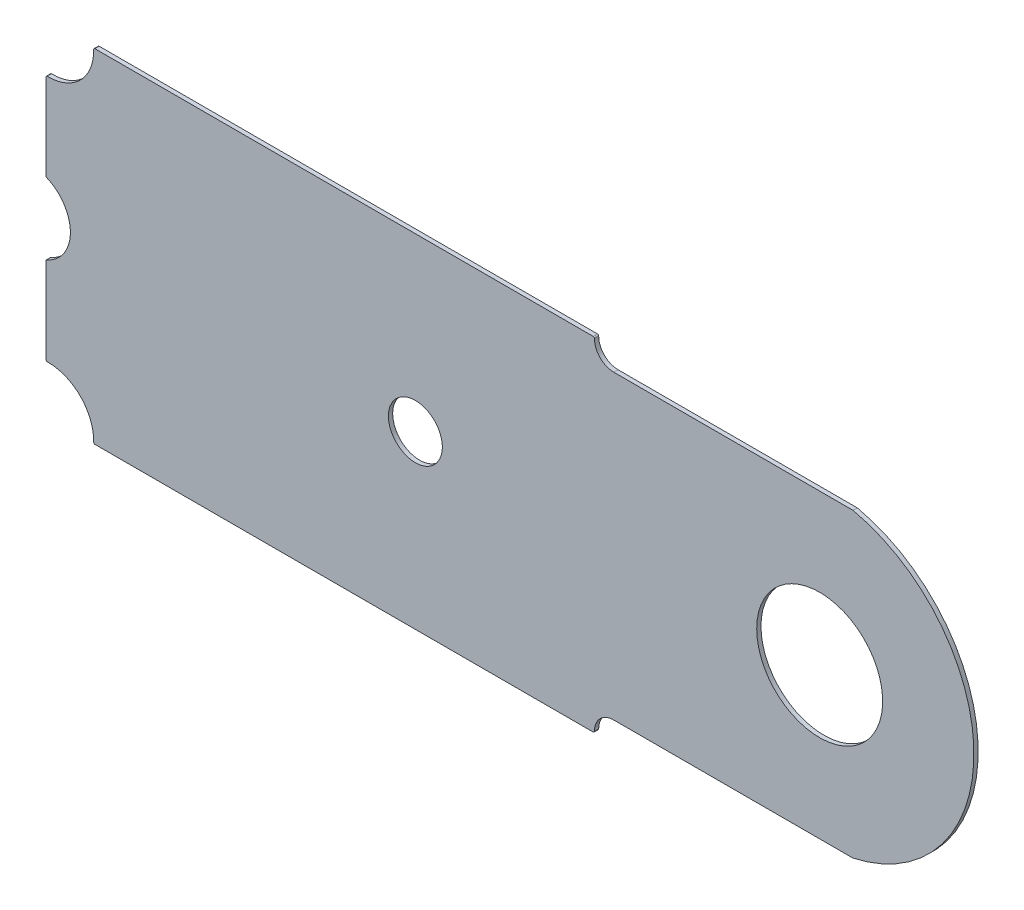
ISO-10303-21;
HEADER;
FILE_DESCRIPTION(('STEP AP214'),'2;1');
FILE_NAME('part.step','',(''),(''),'','','');
FILE_SCHEMA(('AUTOMOTIVE_DESIGN { 1 0 10303 214 1 1 1 1 }'));
ENDSEC;
DATA;
#1=APPLICATION_CONTEXT('core data for automotive mechanical design processes');
#2=APPLICATION_PROTOCOL_DEFINITION('international standard','automotive_design',2000,#1);
#3=PRODUCT_CONTEXT('',#1,'mechanical');
#4=PRODUCT('Part','Part','',(#3));
#5=PRODUCT_RELATED_PRODUCT_CATEGORY('part','',(#4));
#6=PRODUCT_DEFINITION_FORMATION('','',#4);
#7=PRODUCT_DEFINITION_CONTEXT('part definition',#1,'design');
#8=PRODUCT_DEFINITION('design','',#6,#7);
#9=PRODUCT_DEFINITION_SHAPE('','',#8);
#10=(LENGTH_UNIT() NAMED_UNIT(*) SI_UNIT(.MILLI.,.METRE.));
#11=(NAMED_UNIT(*) PLANE_ANGLE_UNIT() SI_UNIT($,.RADIAN.));
#12=(NAMED_UNIT(*) SI_UNIT($,.STERADIAN.) SOLID_ANGLE_UNIT());
#13=UNCERTAINTY_MEASURE_WITH_UNIT(LENGTH_MEASURE(1.E-05),#10,'distance_accuracy_value','');
#14=(GEOMETRIC_REPRESENTATION_CONTEXT(3) GLOBAL_UNCERTAINTY_ASSIGNED_CONTEXT((#13)) GLOBAL_UNIT_ASSIGNED_CONTEXT((#10,
#11,#12)) REPRESENTATION_CONTEXT('',''));
#15=CARTESIAN_POINT('',(0.,0.,0.));
#16=DIRECTION('',(0.,0.,1.));
#17=DIRECTION('',(1.,0.,0.));
#18=AXIS2_PLACEMENT_3D('',#15,#16,#17);
#19=CARTESIAN_POINT('',(-0.12740132,4.5988732,0.41148));
#20=DIRECTION('',(0.,0.,1.));
#21=DIRECTION('',(1.,0.,0.));
#22=AXIS2_PLACEMENT_3D('',#19,#20,#21);
#23=PLANE('',#22);
#24=CARTESIAN_POINT('',(74.50000086,16.40000022,0.41148));
#25=DIRECTION('',(0.,0.,-1.));
#26=DIRECTION('',(-1.,0.,0.));
#27=AXIS2_PLACEMENT_3D('',#24,#25,#26);
#28=CIRCLE('',#27,6.07499928);
#29=CARTESIAN_POINT('',(68.42500158,16.40000022,0.41148));
#30=VERTEX_POINT('',#29);
#31=EDGE_CURVE('E262',#30,#30,#28,.T.);
#32=ORIENTED_EDGE('',*,*,#31,.T.);
#33=EDGE_LOOP('',(#32));
#34=FACE_BOUND('',#33,.T.);
#35=CARTESIAN_POINT('',(35.50000012,16.40000022,0.41148));
#36=DIRECTION('',(0.,0.,-1.));
#37=DIRECTION('',(-1.,0.,0.));
#38=AXIS2_PLACEMENT_3D('',#35,#36,#37);
#39=CIRCLE('',#38,2.59999988);
#40=CARTESIAN_POINT('',(32.90000024,16.40000022,0.41148));
#41=VERTEX_POINT('',#40);
#42=EDGE_CURVE('E265',#41,#41,#39,.T.);
#43=ORIENTED_EDGE('',*,*,#42,.T.);
#44=EDGE_LOOP('',(#43));
#45=FACE_BOUND('',#44,.T.);
#46=CARTESIAN_POINT('',(-1.538549686664E-05,12.854211580344,0.41148));
#47=DIRECTION('',(0.,0.,-1.));
#48=DIRECTION('',(-1.,0.,0.));
#49=AXIS2_PLACEMENT_3D('',#46,#47,#48);
#50=CIRCLE('',#49,0.127385934519);
#51=CARTESIAN_POINT('',(-0.12740132,12.854212570172,0.41148));
#52=VERTEX_POINT('',#51);
#53=CARTESIAN_POINT('',(-0.0489204000002451,12.9718358800006,0.41148));
#54=VERTEX_POINT('',#53);
#55=EDGE_CURVE('E268',#52,#54,#50,.T.);
#56=ORIENTED_EDGE('',*,*,#55,.F.);
#57=DIRECTION('',(0.,1.,0.));
#58=VECTOR('',#57,1.);
#59=CARTESIAN_POINT('',(-0.12740132,4.5988732,0.41148));
#60=LINE('',#59,#58);
#61=CARTESIAN_POINT('',(-0.12740132,4.59887445537,0.41148));
#62=VERTEX_POINT('',#61);
#63=EDGE_CURVE('E169',#62,#52,#60,.T.);
#64=ORIENTED_EDGE('',*,*,#63,.F.);
#65=CARTESIAN_POINT('',(-1.693440224226E-05,4.59887571074,0.41148));
#66=DIRECTION('',(0.,0.,-1.));
#67=DIRECTION('',(-1.,0.,0.));
#68=AXIS2_PLACEMENT_3D('',#65,#66,#67);
#69=CIRCLE('',#68,0.127384385623);
#70=CARTESIAN_POINT('',(0.00281142005705652,4.47152272841615,0.41148));
#71=VERTEX_POINT('',#70);
#72=EDGE_CURVE('E20',#71,#62,#69,.T.);
#73=ORIENTED_EDGE('',*,*,#72,.F.);
#74=CARTESIAN_POINT('',(0.09997510105014,0.09998018105014,0.41148));
#75=DIRECTION('',(0.,0.,-1.));
#76=DIRECTION('',(-1.,0.,0.));
#77=AXIS2_PLACEMENT_3D('',#74,#75,#76);
#78=CIRCLE('',#77,4.372622213807);
#79=CARTESIAN_POINT('',(4.47151764841588,0.00281650005706236,0.41148));
#80=VERTEX_POINT('',#79);
#81=EDGE_CURVE('E167',#71,#80,#78,.T.);
#82=ORIENTED_EDGE('',*,*,#81,.T.);
#83=CARTESIAN_POINT('',(4.59887063074,-1.18544022424E-05,0.41148));
#84=DIRECTION('',(0.,0.,-1.));
#85=DIRECTION('',(-1.,0.,0.));
#86=AXIS2_PLACEMENT_3D('',#83,#84,#85);
#87=CIRCLE('',#86,0.127384385623);
#88=CARTESIAN_POINT('',(4.59886937537,-0.12739624,0.41148));
#89=VERTEX_POINT('',#88);
#90=EDGE_CURVE('E180',#89,#80,#87,.T.);
#91=ORIENTED_EDGE('',*,*,#90,.F.);
#92=DIRECTION('',(1.,0.,0.));
#93=VECTOR('',#92,1.);
#94=CARTESIAN_POINT('',(52.6449798,-0.12739624,0.41148));
#95=LINE('',#94,#93);
#96=CARTESIAN_POINT('',(52.644978043509,-0.12739623999983,0.41148));
#97=VERTEX_POINT('',#96);
#98=EDGE_CURVE('E206',#97,#89,#95,.F.);
#99=ORIENTED_EDGE('',*,*,#98,.F.);
#100=CARTESIAN_POINT('',(52.644976287018,-1.172701809996E-05,0.41148));
#101=DIRECTION('',(0.,0.,-1.));
#102=DIRECTION('',(-1.,0.,0.));
#103=AXIS2_PLACEMENT_3D('',#100,#101,#102);
#104=CIRCLE('',#103,0.12738451303);
#105=CARTESIAN_POINT('',(52.7723608000234,-1.30817822418443E-05,0.41148));
#106=VERTEX_POINT('',#105);
#107=EDGE_CURVE('E304',#106,#97,#104,.T.);
#108=ORIENTED_EDGE('',*,*,#107,.F.);
#109=CARTESIAN_POINT('',(54.644979914304,-1.427430427359E-05,0.41148));
#110=DIRECTION('',(0.,0.,-1.));
#111=DIRECTION('',(-1.,0.,0.));
#112=AXIS2_PLACEMENT_3D('',#109,#110,#111);
#113=CIRCLE('',#112,1.872619114305);
#114=CARTESIAN_POINT('',(54.644980397152,1.87260484,0.41148));
#115=VERTEX_POINT('',#114);
#116=EDGE_CURVE('E205',#106,#115,#113,.T.);
#117=ORIENTED_EDGE('',*,*,#116,.T.);
#118=DIRECTION('',(1.,0.,0.));
#119=VECTOR('',#118,1.);
#120=CARTESIAN_POINT('',(77.69331172,1.87260484,0.41148));
#121=LINE('',#120,#119);
#122=CARTESIAN_POINT('',(77.69331172,1.87260483999942,0.41148));
#123=VERTEX_POINT('',#122);
#124=EDGE_CURVE('E202',#123,#115,#121,.F.);
#125=ORIENTED_EDGE('',*,*,#124,.F.);
#126=CARTESIAN_POINT('',(77.694132975938,1.999830589265,0.41148));
#127=DIRECTION('',(0.,0.,-1.));
#128=DIRECTION('',(-1.,0.,0.));
#129=AXIS2_PLACEMENT_3D('',#126,#127,#128);
#130=CIRCLE('',#129,0.127228399886);
#131=CARTESIAN_POINT('',(77.7217013,1.87562489999992,0.41148));
#132=VERTEX_POINT('',#131);
#133=EDGE_CURVE('E299',#132,#123,#130,.T.);
#134=ORIENTED_EDGE('',*,*,#133,.F.);
#135=CARTESIAN_POINT('',(74.499979432809,16.39998498,0.41148));
#136=DIRECTION('',(0.,0.,-1.));
#137=DIRECTION('',(-1.,0.,0.));
#138=AXIS2_PLACEMENT_3D('',#135,#136,#137);
#139=CIRCLE('',#138,14.877383087191);
#140=CARTESIAN_POINT('',(77.7217012999999,30.9243450599997,0.41148));
#141=VERTEX_POINT('',#140);
#142=EDGE_CURVE('E296',#141,#132,#139,.T.);
#143=ORIENTED_EDGE('',*,*,#142,.F.);
#144=CARTESIAN_POINT('',(77.694132975938,30.800139370734,0.41148));
#145=DIRECTION('',(0.,0.,-1.));
#146=DIRECTION('',(-1.,0.,0.));
#147=AXIS2_PLACEMENT_3D('',#144,#145,#146);
#148=CIRCLE('',#147,0.127228399886);
#149=CARTESIAN_POINT('',(77.69331172,30.92736512,0.41148));
#150=VERTEX_POINT('',#149);
#151=EDGE_CURVE('E293',#150,#141,#148,.T.);
#152=ORIENTED_EDGE('',*,*,#151,.F.);
#153=DIRECTION('',(1.,0.,0.));
#154=VECTOR('',#153,1.);
#155=CARTESIAN_POINT('',(54.64498088,30.92736512,0.41148));
#156=LINE('',#155,#154);
#157=CARTESIAN_POINT('',(54.644980397152,30.9273651199996,0.41148));
#158=VERTEX_POINT('',#157);
#159=EDGE_CURVE('E198',#158,#150,#156,.T.);
#160=ORIENTED_EDGE('',*,*,#159,.F.);
#161=CARTESIAN_POINT('',(54.644979914304,32.799984234304,0.41148));
#162=DIRECTION('',(0.,0.,-1.));
#163=DIRECTION('',(-1.,0.,0.));
#164=AXIS2_PLACEMENT_3D('',#161,#162,#163);
#165=CIRCLE('',#164,1.872619114305);
#166=CARTESIAN_POINT('',(52.7723608000237,32.7999835246301,0.41148));
#167=VERTEX_POINT('',#166);
#168=EDGE_CURVE('E289',#158,#167,#165,.T.);
#169=ORIENTED_EDGE('',*,*,#168,.T.);
#170=CARTESIAN_POINT('',(52.644976287018,32.799981687018,0.41148));
#171=DIRECTION('',(0.,0.,-1.));
#172=DIRECTION('',(-1.,0.,0.));
#173=AXIS2_PLACEMENT_3D('',#170,#171,#172);
#174=CIRCLE('',#173,0.12738451303);
#175=CARTESIAN_POINT('',(52.644978043509,32.9273662,0.41148));
#176=VERTEX_POINT('',#175);
#177=EDGE_CURVE('E287',#176,#167,#174,.T.);
#178=ORIENTED_EDGE('',*,*,#177,.F.);
#179=DIRECTION('',(1.,0.,0.));
#180=VECTOR('',#179,1.);
#181=CARTESIAN_POINT('',(4.59886812,32.9273662,0.41148));
#182=LINE('',#181,#180);
#183=CARTESIAN_POINT('',(4.59886937537,32.9273662000001,0.41148));
#184=VERTEX_POINT('',#183);
#185=EDGE_CURVE('E194',#184,#176,#182,.T.);
#186=ORIENTED_EDGE('',*,*,#185,.F.);
#187=CARTESIAN_POINT('',(4.59887063074,32.799981814402,0.41148));
#188=DIRECTION('',(0.,0.,-1.));
#189=DIRECTION('',(-1.,0.,0.));
#190=AXIS2_PLACEMENT_3D('',#187,#188,#189);
#191=CIRCLE('',#190,0.127384385623);
#192=CARTESIAN_POINT('',(4.47151764841614,32.7971534599428,0.41148));
#193=VERTEX_POINT('',#192);
#194=EDGE_CURVE('E284',#193,#184,#191,.T.);
#195=ORIENTED_EDGE('',*,*,#194,.F.);
#196=CARTESIAN_POINT('',(0.09997510105013,32.69998977895,0.41148));
#197=DIRECTION('',(0.,0.,-1.));
#198=DIRECTION('',(-1.,0.,0.));
#199=AXIS2_PLACEMENT_3D('',#196,#197,#198);
#200=CIRCLE('',#199,4.372622213807);
#201=CARTESIAN_POINT('',(0.00281142005703694,28.3284472315831,0.41148));
#202=VERTEX_POINT('',#201);
#203=EDGE_CURVE('E280',#193,#202,#200,.T.);
#204=ORIENTED_EDGE('',*,*,#203,.T.);
#205=CARTESIAN_POINT('',(-1.693440224867E-05,28.20109424926,0.41148));
#206=DIRECTION('',(0.,0.,-1.));
#207=DIRECTION('',(-1.,0.,0.));
#208=AXIS2_PLACEMENT_3D('',#205,#206,#207);
#209=CIRCLE('',#208,0.127384385622);
#210=CARTESIAN_POINT('',(-0.12740132,28.20109550463,0.41148));
#211=VERTEX_POINT('',#210);
#212=EDGE_CURVE('E278',#211,#202,#209,.T.);
#213=ORIENTED_EDGE('',*,*,#212,.F.);
#214=DIRECTION('',(0.,1.,0.));
#215=VECTOR('',#214,1.);
#216=CARTESIAN_POINT('',(-0.12740132,19.9457564,0.41148));
#217=LINE('',#216,#215);
#218=CARTESIAN_POINT('',(-0.127401320007939,19.945758379656,0.41148));
#219=VERTEX_POINT('',#218);
#220=EDGE_CURVE('E190',#219,#211,#217,.T.);
#221=ORIENTED_EDGE('',*,*,#220,.F.);
#222=CARTESIAN_POINT('',(-1.538549687728E-05,19.945758379656,0.41148));
#223=DIRECTION('',(0.,0.,-1.));
#224=DIRECTION('',(-1.,0.,0.));
#225=AXIS2_PLACEMENT_3D('',#222,#223,#224);
#226=CIRCLE('',#225,0.127385934519);
#227=CARTESIAN_POINT('',(-0.048920400000108,19.8281340799997,0.41148));
#228=VERTEX_POINT('',#227);
#229=EDGE_CURVE('E275',#228,#219,#226,.T.);
#230=ORIENTED_EDGE('',*,*,#229,.F.);
#231=CARTESIAN_POINT('',(-1.500020800142,16.39998498,0.41148));
#232=DIRECTION('',(0.,0.,-1.));
#233=DIRECTION('',(-1.,0.,0.));
#234=AXIS2_PLACEMENT_3D('',#231,#232,#233);
#235=CIRCLE('',#234,3.722619860142);
#236=EDGE_CURVE('E271',#228,#54,#235,.T.);
#237=ORIENTED_EDGE('',*,*,#236,.T.);
#238=EDGE_LOOP('',(#56,#64,#73,#82,#91,#99,#108,#117,#125,#134,#143,#152,#160,#169,#178,#186,
#195,#204,#213,#221,#230,#237));
#239=FACE_BOUND('',#238,.T.);
#240=ADVANCED_FACE('F17',(#34,#45,#239),#23,.T.);
#241=CARTESIAN_POINT('',(-1.693440224226E-05,4.59887571074,0.));
#242=DIRECTION('',(0.,0.,-1.));
#243=DIRECTION('',(-1.,0.,0.));
#244=AXIS2_PLACEMENT_3D('',#241,#242,#243);
#245=CYLINDRICAL_SURFACE('',#244,0.127384385623);
#246=DIRECTION('',(0.,0.,1.));
#247=VECTOR('',#246,1.);
#248=CARTESIAN_POINT('',(-0.12740132,4.5988732,0.));
#249=LINE('',#248,#247);
#250=CARTESIAN_POINT('',(-0.12740132,4.59887445537,0.));
#251=VERTEX_POINT('',#250);
#252=EDGE_CURVE('E189',#251,#62,#249,.T.);
#253=ORIENTED_EDGE('',*,*,#252,.F.);
#254=CARTESIAN_POINT('',(-1.693440224226E-05,4.59887571074,0.));
#255=DIRECTION('',(0.,0.,-1.));
#256=DIRECTION('',(-1.,0.,0.));
#257=AXIS2_PLACEMENT_3D('',#254,#255,#256);
#258=CIRCLE('',#257,0.127384385623);
#259=CARTESIAN_POINT('',(0.00281142005619704,4.47152272845482,0.));
#260=VERTEX_POINT('',#259);
#261=EDGE_CURVE('E183',#251,#260,#258,.F.);
#262=ORIENTED_EDGE('',*,*,#261,.T.);
#263=DIRECTION('',(0.,0.,-1.));
#264=VECTOR('',#263,1.);
#265=CARTESIAN_POINT('',(0.00280923999999986,4.47152268,0.));
#266=LINE('',#265,#264);
#267=EDGE_CURVE('E174',#260,#71,#266,.F.);
#268=ORIENTED_EDGE('',*,*,#267,.T.);
#269=ORIENTED_EDGE('',*,*,#72,.T.);
#270=EDGE_LOOP('',(#253,#262,#268,#269));
#271=FACE_BOUND('',#270,.T.);
#272=ADVANCED_FACE('F182',(#271),#245,.T.);
#273=CARTESIAN_POINT('',(0.09997510105014,0.09998018105014,0.));
#274=DIRECTION('',(0.,0.,-1.));
#275=DIRECTION('',(-1.,0.,0.));
#276=AXIS2_PLACEMENT_3D('',#273,#274,#275);
#277=CYLINDRICAL_SURFACE('',#276,4.372622213807);
#278=ORIENTED_EDGE('',*,*,#81,.F.);
#279=ORIENTED_EDGE('',*,*,#267,.F.);
#280=CARTESIAN_POINT('',(0.09997510105014,0.09998018105014,0.));
#281=DIRECTION('',(0.,0.,-1.));
#282=DIRECTION('',(-1.,0.,0.));
#283=AXIS2_PLACEMENT_3D('',#280,#281,#282);
#284=CIRCLE('',#283,4.372622213807);
#285=CARTESIAN_POINT('',(4.47151764841588,0.00281650005706236,0.));
#286=VERTEX_POINT('',#285);
#287=EDGE_CURVE('E259',#260,#286,#284,.T.);
#288=ORIENTED_EDGE('',*,*,#287,.T.);
#289=DIRECTION('',(0.,0.,-1.));
#290=VECTOR('',#289,1.);
#291=CARTESIAN_POINT('',(4.47151759999947,0.00281432000001167,0.));
#292=LINE('',#291,#290);
#293=EDGE_CURVE('E179',#80,#286,#292,.T.);
#294=ORIENTED_EDGE('',*,*,#293,.F.);
#295=EDGE_LOOP('',(#278,#279,#288,#294));
#296=FACE_BOUND('',#295,.T.);
#297=ADVANCED_FACE('F176',(#296),#277,.F.);
#298=CARTESIAN_POINT('',(4.59887063074,-1.18544022424E-05,0.));
#299=DIRECTION('',(0.,0.,-1.));
#300=DIRECTION('',(-1.,0.,0.));
#301=AXIS2_PLACEMENT_3D('',#298,#299,#300);
#302=CYLINDRICAL_SURFACE('',#301,0.127384385623);
#303=ORIENTED_EDGE('',*,*,#293,.T.);
#304=CARTESIAN_POINT('',(4.59887063074,-1.18544022424E-05,0.));
#305=DIRECTION('',(0.,0.,-1.));
#306=DIRECTION('',(-1.,0.,0.));
#307=AXIS2_PLACEMENT_3D('',#304,#305,#306);
#308=CIRCLE('',#307,0.127384385623);
#309=CARTESIAN_POINT('',(4.59886937537,-0.12739624,0.));
#310=VERTEX_POINT('',#309);
#311=EDGE_CURVE('E256',#286,#310,#308,.F.);
#312=ORIENTED_EDGE('',*,*,#311,.T.);
#313=DIRECTION('',(0.,0.,-1.));
#314=VECTOR('',#313,1.);
#315=CARTESIAN_POINT('',(4.59886812,-0.12739624,0.));
#316=LINE('',#315,#314);
#317=EDGE_CURVE('E207',#89,#310,#316,.T.);
#318=ORIENTED_EDGE('',*,*,#317,.F.);
#319=ORIENTED_EDGE('',*,*,#90,.T.);
#320=EDGE_LOOP('',(#303,#312,#318,#319));
#321=FACE_BOUND('',#320,.T.);
#322=ADVANCED_FACE('F310',(#321),#302,.T.);
#323=CARTESIAN_POINT('',(52.6449798,-0.12739624,0.));
#324=DIRECTION('',(0.,-1.,0.));
#325=DIRECTION('',(0.,0.,-1.));
#326=AXIS2_PLACEMENT_3D('',#323,#324,#325);
#327=PLANE('',#326);
#328=ORIENTED_EDGE('',*,*,#317,.T.);
#329=DIRECTION('',(1.,0.,0.));
#330=VECTOR('',#329,1.);
#331=CARTESIAN_POINT('',(-0.12740132,-0.12739624,0.));
#332=LINE('',#331,#330);
#333=CARTESIAN_POINT('',(52.644978043509,-0.12739623999983,0.));
#334=VERTEX_POINT('',#333);
#335=EDGE_CURVE('E255',#310,#334,#332,.T.);
#336=ORIENTED_EDGE('',*,*,#335,.T.);
#337=DIRECTION('',(0.,0.,-1.));
#338=VECTOR('',#337,1.);
#339=CARTESIAN_POINT('',(52.6449798,-0.12739623999966,0.));
#340=LINE('',#339,#338);
#341=EDGE_CURVE('E306',#97,#334,#340,.T.);
#342=ORIENTED_EDGE('',*,*,#341,.F.);
#343=ORIENTED_EDGE('',*,*,#98,.T.);
#344=EDGE_LOOP('',(#328,#336,#342,#343));
#345=FACE_BOUND('',#344,.T.);
#346=ADVANCED_FACE('F346',(#345),#327,.T.);
#347=CARTESIAN_POINT('',(52.644976287018,-1.172701809996E-05,0.));
#348=DIRECTION('',(0.,0.,-1.));
#349=DIRECTION('',(-1.,0.,0.));
#350=AXIS2_PLACEMENT_3D('',#347,#348,#349);
#351=CYLINDRICAL_SURFACE('',#350,0.12738451303);
#352=ORIENTED_EDGE('',*,*,#341,.T.);
#353=CARTESIAN_POINT('',(52.644976287018,-1.172701809996E-05,0.));
#354=DIRECTION('',(0.,0.,-1.));
#355=DIRECTION('',(-1.,0.,0.));
#356=AXIS2_PLACEMENT_3D('',#353,#354,#355);
#357=CIRCLE('',#356,0.12738451303);
#358=CARTESIAN_POINT('',(52.7723607999998,-1.30817822418141E-05,0.));
#359=VERTEX_POINT('',#358);
#360=EDGE_CURVE('E252',#334,#359,#357,.F.);
#361=ORIENTED_EDGE('',*,*,#360,.T.);
#362=DIRECTION('',(0.,0.,-1.));
#363=VECTOR('',#362,1.);
#364=CARTESIAN_POINT('',(52.772360799999,-1.427430427359E-05,0.));
#365=LINE('',#364,#363);
#366=EDGE_CURVE('E303',#359,#106,#365,.F.);
#367=ORIENTED_EDGE('',*,*,#366,.T.);
#368=ORIENTED_EDGE('',*,*,#107,.T.);
#369=EDGE_LOOP('',(#352,#361,#367,#368));
#370=FACE_BOUND('',#369,.T.);
#371=ADVANCED_FACE('F354',(#370),#351,.T.);
#372=CARTESIAN_POINT('',(54.644979914304,-1.427430427359E-05,0.));
#373=DIRECTION('',(0.,0.,-1.));
#374=DIRECTION('',(-1.,0.,0.));
#375=AXIS2_PLACEMENT_3D('',#372,#373,#374);
#376=CYLINDRICAL_SURFACE('',#375,1.872619114305);
#377=ORIENTED_EDGE('',*,*,#116,.F.);
#378=ORIENTED_EDGE('',*,*,#366,.F.);
#379=CARTESIAN_POINT('',(54.644979914304,-1.427430427359E-05,0.));
#380=DIRECTION('',(0.,0.,-1.));
#381=DIRECTION('',(-1.,0.,0.));
#382=AXIS2_PLACEMENT_3D('',#379,#380,#381);
#383=CIRCLE('',#382,1.872619114305);
#384=CARTESIAN_POINT('',(54.644980397152,1.87260484,0.));
#385=VERTEX_POINT('',#384);
#386=EDGE_CURVE('E249',#359,#385,#383,.T.);
#387=ORIENTED_EDGE('',*,*,#386,.T.);
#388=DIRECTION('',(0.,0.,-1.));
#389=VECTOR('',#388,1.);
#390=CARTESIAN_POINT('',(54.64498088,1.87260484,0.));
#391=LINE('',#390,#389);
#392=EDGE_CURVE('E204',#115,#385,#391,.T.);
#393=ORIENTED_EDGE('',*,*,#392,.F.);
#394=EDGE_LOOP('',(#377,#378,#387,#393));
#395=FACE_BOUND('',#394,.T.);
#396=ADVANCED_FACE('F353',(#395),#376,.F.);
#397=CARTESIAN_POINT('',(77.69331172,1.87260484,0.));
#398=DIRECTION('',(0.,-1.,0.));
#399=DIRECTION('',(0.,0.,-1.));
#400=AXIS2_PLACEMENT_3D('',#397,#398,#399);
#401=PLANE('',#400);
#402=ORIENTED_EDGE('',*,*,#392,.T.);
#403=DIRECTION('',(1.,0.,0.));
#404=VECTOR('',#403,1.);
#405=CARTESIAN_POINT('',(-0.12740132,1.87260484,0.));
#406=LINE('',#405,#404);
#407=CARTESIAN_POINT('',(77.69331172,1.87260483999942,0.));
#408=VERTEX_POINT('',#407);
#409=EDGE_CURVE('E248',#385,#408,#406,.T.);
#410=ORIENTED_EDGE('',*,*,#409,.T.);
#411=DIRECTION('',(0.,0.,-1.));
#412=VECTOR('',#411,1.);
#413=CARTESIAN_POINT('',(77.69331172,1.87260483999923,0.));
#414=LINE('',#413,#412);
#415=EDGE_CURVE('E298',#123,#408,#414,.T.);
#416=ORIENTED_EDGE('',*,*,#415,.F.);
#417=ORIENTED_EDGE('',*,*,#124,.T.);
#418=EDGE_LOOP('',(#402,#410,#416,#417));
#419=FACE_BOUND('',#418,.T.);
#420=ADVANCED_FACE('F362',(#419),#401,.T.);
#421=CARTESIAN_POINT('',(77.694132975938,1.999830589265,0.));
#422=DIRECTION('',(0.,0.,-1.));
#423=DIRECTION('',(-1.,0.,0.));
#424=AXIS2_PLACEMENT_3D('',#421,#422,#423);
#425=CYLINDRICAL_SURFACE('',#424,0.127228399886);
#426=ORIENTED_EDGE('',*,*,#415,.T.);
#427=CARTESIAN_POINT('',(77.694132975938,1.999830589265,0.));
#428=DIRECTION('',(0.,0.,-1.));
#429=DIRECTION('',(-1.,0.,0.));
#430=AXIS2_PLACEMENT_3D('',#427,#428,#429);
#431=CIRCLE('',#430,0.127228399886);
#432=CARTESIAN_POINT('',(77.7217013,1.87562489999992,0.));
#433=VERTEX_POINT('',#432);
#434=EDGE_CURVE('E245',#408,#433,#431,.F.);
#435=ORIENTED_EDGE('',*,*,#434,.T.);
#436=DIRECTION('',(0.,0.,-1.));
#437=VECTOR('',#436,1.);
#438=CARTESIAN_POINT('',(77.7217013,1.87562489999992,0.));
#439=LINE('',#438,#437);
#440=EDGE_CURVE('E295',#132,#433,#439,.T.);
#441=ORIENTED_EDGE('',*,*,#440,.F.);
#442=ORIENTED_EDGE('',*,*,#133,.T.);
#443=EDGE_LOOP('',(#426,#435,#441,#442));
#444=FACE_BOUND('',#443,.T.);
#445=ADVANCED_FACE('F435',(#444),#425,.T.);
#446=CARTESIAN_POINT('',(74.499979432809,16.39998498,0.));
#447=DIRECTION('',(0.,0.,-1.));
#448=DIRECTION('',(-1.,0.,0.));
#449=AXIS2_PLACEMENT_3D('',#446,#447,#448);
#450=CYLINDRICAL_SURFACE('',#449,14.877383087191);
#451=ORIENTED_EDGE('',*,*,#440,.T.);
#452=CARTESIAN_POINT('',(74.499979432809,16.39998498,0.));
#453=DIRECTION('',(0.,0.,-1.));
#454=DIRECTION('',(-1.,0.,0.));
#455=AXIS2_PLACEMENT_3D('',#452,#453,#454);
#456=CIRCLE('',#455,14.877383087191);
#457=CARTESIAN_POINT('',(77.7217012999999,30.9243450599997,0.));
#458=VERTEX_POINT('',#457);
#459=EDGE_CURVE('E242',#433,#458,#456,.F.);
#460=ORIENTED_EDGE('',*,*,#459,.T.);
#461=DIRECTION('',(0.,0.,-1.));
#462=VECTOR('',#461,1.);
#463=CARTESIAN_POINT('',(77.7217012999999,30.9243450599997,0.));
#464=LINE('',#463,#462);
#465=EDGE_CURVE('E201',#141,#458,#464,.T.);
#466=ORIENTED_EDGE('',*,*,#465,.F.);
#467=ORIENTED_EDGE('',*,*,#142,.T.);
#468=EDGE_LOOP('',(#451,#460,#466,#467));
#469=FACE_BOUND('',#468,.T.);
#470=ADVANCED_FACE('F431',(#469),#450,.T.);
#471=CARTESIAN_POINT('',(77.694132975938,30.800139370734,0.));
#472=DIRECTION('',(0.,0.,-1.));
#473=DIRECTION('',(-1.,0.,0.));
#474=AXIS2_PLACEMENT_3D('',#471,#472,#473);
#475=CYLINDRICAL_SURFACE('',#474,0.127228399886);
#476=ORIENTED_EDGE('',*,*,#465,.T.);
#477=CARTESIAN_POINT('',(77.694132975938,30.800139370734,0.));
#478=DIRECTION('',(0.,0.,-1.));
#479=DIRECTION('',(-1.,0.,0.));
#480=AXIS2_PLACEMENT_3D('',#477,#478,#479);
#481=CIRCLE('',#480,0.127228399886);
#482=CARTESIAN_POINT('',(77.6933117199999,30.92736512,0.));
#483=VERTEX_POINT('',#482);
#484=EDGE_CURVE('E239',#458,#483,#481,.F.);
#485=ORIENTED_EDGE('',*,*,#484,.T.);
#486=DIRECTION('',(0.,0.,1.));
#487=VECTOR('',#486,1.);
#488=CARTESIAN_POINT('',(77.69331172,30.92736512,0.));
#489=LINE('',#488,#487);
#490=EDGE_CURVE('E200',#150,#483,#489,.F.);
#491=ORIENTED_EDGE('',*,*,#490,.F.);
#492=ORIENTED_EDGE('',*,*,#151,.T.);
#493=EDGE_LOOP('',(#476,#485,#491,#492));
#494=FACE_BOUND('',#493,.T.);
#495=ADVANCED_FACE('F427',(#494),#475,.T.);
#496=CARTESIAN_POINT('',(54.64498088,30.92736512,0.));
#497=DIRECTION('',(0.,1.,0.));
#498=DIRECTION('',(0.,0.,1.));
#499=AXIS2_PLACEMENT_3D('',#496,#497,#498);
#500=PLANE('',#499);
#501=ORIENTED_EDGE('',*,*,#490,.T.);
#502=DIRECTION('',(1.,0.,0.));
#503=VECTOR('',#502,1.);
#504=CARTESIAN_POINT('',(-0.12740132,30.92736512,0.));
#505=LINE('',#504,#503);
#506=CARTESIAN_POINT('',(54.644980397152,30.9273651199996,0.));
#507=VERTEX_POINT('',#506);
#508=EDGE_CURVE('E238',#483,#507,#505,.F.);
#509=ORIENTED_EDGE('',*,*,#508,.T.);
#510=DIRECTION('',(0.,0.,-1.));
#511=VECTOR('',#510,1.);
#512=CARTESIAN_POINT('',(54.64498088,30.9273651199992,0.));
#513=LINE('',#512,#511);
#514=EDGE_CURVE('E292',#507,#158,#513,.F.);
#515=ORIENTED_EDGE('',*,*,#514,.T.);
#516=ORIENTED_EDGE('',*,*,#159,.T.);
#517=EDGE_LOOP('',(#501,#509,#515,#516));
#518=FACE_BOUND('',#517,.T.);
#519=ADVANCED_FACE('F423',(#518),#500,.T.);
#520=CARTESIAN_POINT('',(54.644979914304,32.799984234304,0.));
#521=DIRECTION('',(0.,0.,-1.));
#522=DIRECTION('',(-1.,0.,0.));
#523=AXIS2_PLACEMENT_3D('',#520,#521,#522);
#524=CYLINDRICAL_SURFACE('',#523,1.872619114305);
#525=ORIENTED_EDGE('',*,*,#168,.F.);
#526=ORIENTED_EDGE('',*,*,#514,.F.);
#527=CARTESIAN_POINT('',(54.644979914304,32.799984234304,0.));
#528=DIRECTION('',(0.,0.,-1.));
#529=DIRECTION('',(-1.,0.,0.));
#530=AXIS2_PLACEMENT_3D('',#527,#528,#529);
#531=CIRCLE('',#530,1.872619114305);
#532=CARTESIAN_POINT('',(52.7723608000237,32.7999835246301,0.));
#533=VERTEX_POINT('',#532);
#534=EDGE_CURVE('E235',#507,#533,#531,.T.);
#535=ORIENTED_EDGE('',*,*,#534,.T.);
#536=DIRECTION('',(0.,0.,-1.));
#537=VECTOR('',#536,1.);
#538=CARTESIAN_POINT('',(52.7723607999996,32.7999852,0.));
#539=LINE('',#538,#537);
#540=EDGE_CURVE('E197',#167,#533,#539,.T.);
#541=ORIENTED_EDGE('',*,*,#540,.F.);
#542=EDGE_LOOP('',(#525,#526,#535,#541));
#543=FACE_BOUND('',#542,.T.);
#544=ADVANCED_FACE('F419',(#543),#524,.F.);
#545=CARTESIAN_POINT('',(52.644976287018,32.799981687018,0.));
#546=DIRECTION('',(0.,0.,-1.));
#547=DIRECTION('',(-1.,0.,0.));
#548=AXIS2_PLACEMENT_3D('',#545,#546,#547);
#549=CYLINDRICAL_SURFACE('',#548,0.12738451303);
#550=ORIENTED_EDGE('',*,*,#540,.T.);
#551=CARTESIAN_POINT('',(52.644976287018,32.799981687018,0.));
#552=DIRECTION('',(0.,0.,-1.));
#553=DIRECTION('',(-1.,0.,0.));
#554=AXIS2_PLACEMENT_3D('',#551,#552,#553);
#555=CIRCLE('',#554,0.12738451303);
#556=CARTESIAN_POINT('',(52.644978043509,32.9273662,0.));
#557=VERTEX_POINT('',#556);
#558=EDGE_CURVE('E232',#533,#557,#555,.F.);
#559=ORIENTED_EDGE('',*,*,#558,.T.);
#560=DIRECTION('',(0.,0.,1.));
#561=VECTOR('',#560,1.);
#562=CARTESIAN_POINT('',(52.6449798,32.9273662,0.));
#563=LINE('',#562,#561);
#564=EDGE_CURVE('E196',#176,#557,#563,.F.);
#565=ORIENTED_EDGE('',*,*,#564,.F.);
#566=ORIENTED_EDGE('',*,*,#177,.T.);
#567=EDGE_LOOP('',(#550,#559,#565,#566));
#568=FACE_BOUND('',#567,.T.);
#569=ADVANCED_FACE('F415',(#568),#549,.T.);
#570=CARTESIAN_POINT('',(4.59886812,32.9273662,0.));
#571=DIRECTION('',(0.,1.,0.));
#572=DIRECTION('',(0.,0.,1.));
#573=AXIS2_PLACEMENT_3D('',#570,#571,#572);
#574=PLANE('',#573);
#575=ORIENTED_EDGE('',*,*,#564,.T.);
#576=DIRECTION('',(1.,0.,0.));
#577=VECTOR('',#576,1.);
#578=CARTESIAN_POINT('',(-0.12740132,32.9273662,0.));
#579=LINE('',#578,#577);
#580=CARTESIAN_POINT('',(4.59886937537,32.9273662000001,0.));
#581=VERTEX_POINT('',#580);
#582=EDGE_CURVE('E231',#557,#581,#579,.F.);
#583=ORIENTED_EDGE('',*,*,#582,.T.);
#584=DIRECTION('',(0.,0.,-1.));
#585=VECTOR('',#584,1.);
#586=CARTESIAN_POINT('',(4.59886812,32.9273662000003,0.));
#587=LINE('',#586,#585);
#588=EDGE_CURVE('E286',#184,#581,#587,.T.);
#589=ORIENTED_EDGE('',*,*,#588,.F.);
#590=ORIENTED_EDGE('',*,*,#185,.T.);
#591=EDGE_LOOP('',(#575,#583,#589,#590));
#592=FACE_BOUND('',#591,.T.);
#593=ADVANCED_FACE('F411',(#592),#574,.T.);
#594=CARTESIAN_POINT('',(4.59887063074,32.799981814402,0.));
#595=DIRECTION('',(0.,0.,-1.));
#596=DIRECTION('',(-1.,0.,0.));
#597=AXIS2_PLACEMENT_3D('',#594,#595,#596);
#598=CYLINDRICAL_SURFACE('',#597,0.127384385623);
#599=ORIENTED_EDGE('',*,*,#588,.T.);
#600=CARTESIAN_POINT('',(4.59887063074,32.799981814402,0.));
#601=DIRECTION('',(0.,0.,-1.));
#602=DIRECTION('',(-1.,0.,0.));
#603=AXIS2_PLACEMENT_3D('',#600,#601,#602);
#604=CIRCLE('',#603,0.127384385623);
#605=CARTESIAN_POINT('',(4.47151764845481,32.7971534599437,0.));
#606=VERTEX_POINT('',#605);
#607=EDGE_CURVE('E228',#581,#606,#604,.F.);
#608=ORIENTED_EDGE('',*,*,#607,.T.);
#609=DIRECTION('',(0.,0.,-1.));
#610=VECTOR('',#609,1.);
#611=CARTESIAN_POINT('',(4.4715176,32.79715564,0.));
#612=LINE('',#611,#610);
#613=EDGE_CURVE('E283',#606,#193,#612,.F.);
#614=ORIENTED_EDGE('',*,*,#613,.T.);
#615=ORIENTED_EDGE('',*,*,#194,.T.);
#616=EDGE_LOOP('',(#599,#608,#614,#615));
#617=FACE_BOUND('',#616,.T.);
#618=ADVANCED_FACE('F407',(#617),#598,.T.);
#619=CARTESIAN_POINT('',(0.09997510105013,32.69998977895,0.));
#620=DIRECTION('',(0.,0.,-1.));
#621=DIRECTION('',(-1.,0.,0.));
#622=AXIS2_PLACEMENT_3D('',#619,#620,#621);
#623=CYLINDRICAL_SURFACE('',#622,4.372622213807);
#624=ORIENTED_EDGE('',*,*,#203,.F.);
#625=ORIENTED_EDGE('',*,*,#613,.F.);
#626=CARTESIAN_POINT('',(0.09997510105013,32.69998977895,0.));
#627=DIRECTION('',(0.,0.,-1.));
#628=DIRECTION('',(-1.,0.,0.));
#629=AXIS2_PLACEMENT_3D('',#626,#627,#628);
#630=CIRCLE('',#629,4.372622213807);
#631=CARTESIAN_POINT('',(0.00281142005703694,28.3284472315831,0.));
#632=VERTEX_POINT('',#631);
#633=EDGE_CURVE('E225',#606,#632,#630,.T.);
#634=ORIENTED_EDGE('',*,*,#633,.T.);
#635=DIRECTION('',(0.,0.,-1.));
#636=VECTOR('',#635,1.);
#637=CARTESIAN_POINT('',(0.00280923999998951,28.3284472799995,0.));
#638=LINE('',#637,#636);
#639=EDGE_CURVE('E193',#202,#632,#638,.T.);
#640=ORIENTED_EDGE('',*,*,#639,.F.);
#641=EDGE_LOOP('',(#624,#625,#634,#640));
#642=FACE_BOUND('',#641,.T.);
#643=ADVANCED_FACE('F403',(#642),#623,.F.);
#644=CARTESIAN_POINT('',(-1.693440224867E-05,28.20109424926,0.));
#645=DIRECTION('',(0.,0.,-1.));
#646=DIRECTION('',(-1.,0.,0.));
#647=AXIS2_PLACEMENT_3D('',#644,#645,#646);
#648=CYLINDRICAL_SURFACE('',#647,0.127384385622);
#649=ORIENTED_EDGE('',*,*,#639,.T.);
#650=CARTESIAN_POINT('',(-1.693440224867E-05,28.20109424926,0.));
#651=DIRECTION('',(0.,0.,-1.));
#652=DIRECTION('',(-1.,0.,0.));
#653=AXIS2_PLACEMENT_3D('',#650,#651,#652);
#654=CIRCLE('',#653,0.127384385622);
#655=CARTESIAN_POINT('',(-0.12740132,28.20109550463,0.));
#656=VERTEX_POINT('',#655);
#657=EDGE_CURVE('E222',#632,#656,#654,.F.);
#658=ORIENTED_EDGE('',*,*,#657,.T.);
#659=DIRECTION('',(0.,0.,1.));
#660=VECTOR('',#659,1.);
#661=CARTESIAN_POINT('',(-0.12740132,28.20109676,0.));
#662=LINE('',#661,#660);
#663=EDGE_CURVE('E192',#211,#656,#662,.F.);
#664=ORIENTED_EDGE('',*,*,#663,.F.);
#665=ORIENTED_EDGE('',*,*,#212,.T.);
#666=EDGE_LOOP('',(#649,#658,#664,#665));
#667=FACE_BOUND('',#666,.T.);
#668=ADVANCED_FACE('F399',(#667),#648,.T.);
#669=CARTESIAN_POINT('',(-0.12740132,19.9457564,0.));
#670=DIRECTION('',(-1.,0.,0.));
#671=DIRECTION('',(0.,0.,1.));
#672=AXIS2_PLACEMENT_3D('',#669,#670,#671);
#673=PLANE('',#672);
#674=ORIENTED_EDGE('',*,*,#663,.T.);
#675=DIRECTION('',(0.,1.,0.));
#676=VECTOR('',#675,1.);
#677=CARTESIAN_POINT('',(-0.12740132,4.5988732,0.));
#678=LINE('',#677,#676);
#679=CARTESIAN_POINT('',(-0.127401320007939,19.945758379656,0.));
#680=VERTEX_POINT('',#679);
#681=EDGE_CURVE('E221',#656,#680,#678,.F.);
#682=ORIENTED_EDGE('',*,*,#681,.T.);
#683=DIRECTION('',(0.,0.,-1.));
#684=VECTOR('',#683,1.);
#685=CARTESIAN_POINT('',(-0.127401320015877,19.945758379656,0.));
#686=LINE('',#685,#684);
#687=EDGE_CURVE('E277',#219,#680,#686,.T.);
#688=ORIENTED_EDGE('',*,*,#687,.F.);
#689=ORIENTED_EDGE('',*,*,#220,.T.);
#690=EDGE_LOOP('',(#674,#682,#688,#689));
#691=FACE_BOUND('',#690,.T.);
#692=ADVANCED_FACE('F395',(#691),#673,.T.);
#693=CARTESIAN_POINT('',(-1.538549687728E-05,19.945758379656,0.));
#694=DIRECTION('',(0.,0.,-1.));
#695=DIRECTION('',(-1.,0.,0.));
#696=AXIS2_PLACEMENT_3D('',#693,#694,#695);
#697=CYLINDRICAL_SURFACE('',#696,0.127385934519);
#698=ORIENTED_EDGE('',*,*,#687,.T.);
#699=CARTESIAN_POINT('',(-1.538549687728E-05,19.945758379656,0.));
#700=DIRECTION('',(0.,0.,-1.));
#701=DIRECTION('',(-1.,0.,0.));
#702=AXIS2_PLACEMENT_3D('',#699,#700,#701);
#703=CIRCLE('',#702,0.127385934519);
#704=CARTESIAN_POINT('',(-0.0489203999999698,19.8281340800001,0.));
#705=VERTEX_POINT('',#704);
#706=EDGE_CURVE('E218',#680,#705,#703,.F.);
#707=ORIENTED_EDGE('',*,*,#706,.T.);
#708=DIRECTION('',(0.,0.,-1.));
#709=VECTOR('',#708,1.);
#710=CARTESIAN_POINT('',(-0.0489203999999698,19.8281340800001,0.));
#711=LINE('',#710,#709);
#712=EDGE_CURVE('E274',#705,#228,#711,.F.);
#713=ORIENTED_EDGE('',*,*,#712,.T.);
#714=ORIENTED_EDGE('',*,*,#229,.T.);
#715=EDGE_LOOP('',(#698,#707,#713,#714));
#716=FACE_BOUND('',#715,.T.);
#717=ADVANCED_FACE('F391',(#716),#697,.T.);
#718=CARTESIAN_POINT('',(-1.500020800142,16.39998498,0.));
#719=DIRECTION('',(0.,0.,-1.));
#720=DIRECTION('',(-1.,0.,0.));
#721=AXIS2_PLACEMENT_3D('',#718,#719,#720);
#722=CYLINDRICAL_SURFACE('',#721,3.722619860142);
#723=ORIENTED_EDGE('',*,*,#236,.F.);
#724=ORIENTED_EDGE('',*,*,#712,.F.);
#725=CARTESIAN_POINT('',(-1.500020800142,16.39998498,0.));
#726=DIRECTION('',(0.,0.,-1.));
#727=DIRECTION('',(-1.,0.,0.));
#728=AXIS2_PLACEMENT_3D('',#725,#726,#727);
#729=CIRCLE('',#728,3.722619860142);
#730=CARTESIAN_POINT('',(-0.048920400000245,12.9718358800006,0.));
#731=VERTEX_POINT('',#730);
#732=EDGE_CURVE('E215',#705,#731,#729,.T.);
#733=ORIENTED_EDGE('',*,*,#732,.T.);
#734=DIRECTION('',(0.,0.,-1.));
#735=VECTOR('',#734,1.);
#736=CARTESIAN_POINT('',(-0.0489204000002449,12.9718358800006,0.));
#737=LINE('',#736,#735);
#738=EDGE_CURVE('E270',#54,#731,#737,.T.);
#739=ORIENTED_EDGE('',*,*,#738,.F.);
#740=EDGE_LOOP('',(#723,#724,#733,#739));
#741=FACE_BOUND('',#740,.T.);
#742=ADVANCED_FACE('F387',(#741),#722,.F.);
#743=CARTESIAN_POINT('',(-1.538549686664E-05,12.854211580344,0.));
#744=DIRECTION('',(0.,0.,-1.));
#745=DIRECTION('',(-1.,0.,0.));
#746=AXIS2_PLACEMENT_3D('',#743,#744,#745);
#747=CYLINDRICAL_SURFACE('',#746,0.127385934519);
#748=ORIENTED_EDGE('',*,*,#738,.T.);
#749=CARTESIAN_POINT('',(-1.538549686664E-05,12.854211580344,0.));
#750=DIRECTION('',(0.,0.,-1.));
#751=DIRECTION('',(-1.,0.,0.));
#752=AXIS2_PLACEMENT_3D('',#749,#750,#751);
#753=CIRCLE('',#752,0.127385934519);
#754=CARTESIAN_POINT('',(-0.12740132,12.854212570172,0.));
#755=VERTEX_POINT('',#754);
#756=EDGE_CURVE('E212',#731,#755,#753,.F.);
#757=ORIENTED_EDGE('',*,*,#756,.T.);
#758=DIRECTION('',(0.,0.,1.));
#759=VECTOR('',#758,1.);
#760=CARTESIAN_POINT('',(-0.12740132,12.85421356,0.));
#761=LINE('',#760,#759);
#762=EDGE_CURVE('E35',#52,#755,#761,.F.);
#763=ORIENTED_EDGE('',*,*,#762,.F.);
#764=ORIENTED_EDGE('',*,*,#55,.T.);
#765=EDGE_LOOP('',(#748,#757,#763,#764));
#766=FACE_BOUND('',#765,.T.);
#767=ADVANCED_FACE('F384',(#766),#747,.T.);
#768=CARTESIAN_POINT('',(-0.12740132,4.5988732,0.));
#769=DIRECTION('',(-1.,0.,0.));
#770=DIRECTION('',(0.,0.,1.));
#771=AXIS2_PLACEMENT_3D('',#768,#769,#770);
#772=PLANE('',#771);
#773=ORIENTED_EDGE('',*,*,#762,.T.);
#774=DIRECTION('',(0.,1.,0.));
#775=VECTOR('',#774,1.);
#776=CARTESIAN_POINT('',(-0.12740132,4.5988732,0.));
#777=LINE('',#776,#775);
#778=EDGE_CURVE('E211',#755,#251,#777,.F.);
#779=ORIENTED_EDGE('',*,*,#778,.T.);
#780=ORIENTED_EDGE('',*,*,#252,.T.);
#781=ORIENTED_EDGE('',*,*,#63,.T.);
#782=EDGE_LOOP('',(#773,#779,#780,#781));
#783=FACE_BOUND('',#782,.T.);
#784=ADVANCED_FACE('F380',(#783),#772,.T.);
#785=CARTESIAN_POINT('',(35.50000012,16.40000022,0.));
#786=DIRECTION('',(0.,0.,-1.));
#787=DIRECTION('',(-1.,0.,0.));
#788=AXIS2_PLACEMENT_3D('',#785,#786,#787);
#789=CYLINDRICAL_SURFACE('',#788,2.59999988);
#790=ORIENTED_EDGE('',*,*,#42,.F.);
#791=EDGE_LOOP('',(#790));
#792=FACE_BOUND('',#791,.T.);
#793=CARTESIAN_POINT('',(35.50000012,16.40000022,0.));
#794=DIRECTION('',(0.,0.,-1.));
#795=DIRECTION('',(-1.,0.,0.));
#796=AXIS2_PLACEMENT_3D('',#793,#794,#795);
#797=CIRCLE('',#796,2.59999988);
#798=CARTESIAN_POINT('',(32.90000024,16.40000022,0.));
#799=VERTEX_POINT('',#798);
#800=EDGE_CURVE('E26',#799,#799,#797,.T.);
#801=ORIENTED_EDGE('',*,*,#800,.T.);
#802=EDGE_LOOP('',(#801));
#803=FACE_BOUND('',#802,.T.);
#804=ADVANCED_FACE('F372',(#792,#803),#789,.F.);
#805=CARTESIAN_POINT('',(74.50000086,16.40000022,0.));
#806=DIRECTION('',(0.,0.,-1.));
#807=DIRECTION('',(-1.,0.,0.));
#808=AXIS2_PLACEMENT_3D('',#805,#806,#807);
#809=CYLINDRICAL_SURFACE('',#808,6.07499928);
#810=ORIENTED_EDGE('',*,*,#31,.F.);
#811=EDGE_LOOP('',(#810));
#812=FACE_BOUND('',#811,.T.);
#813=CARTESIAN_POINT('',(74.50000086,16.40000022,0.));
#814=DIRECTION('',(0.,0.,-1.));
#815=DIRECTION('',(-1.,0.,0.));
#816=AXIS2_PLACEMENT_3D('',#813,#814,#815);
#817=CIRCLE('',#816,6.07499928);
#818=CARTESIAN_POINT('',(68.42500158,16.40000022,0.));
#819=VERTEX_POINT('',#818);
#820=EDGE_CURVE('E11',#819,#819,#817,.T.);
#821=ORIENTED_EDGE('',*,*,#820,.T.);
#822=EDGE_LOOP('',(#821));
#823=FACE_BOUND('',#822,.T.);
#824=ADVANCED_FACE('F366',(#812,#823),#809,.F.);
#825=CARTESIAN_POINT('',(-0.12740132,4.5988732,0.));
#826=DIRECTION('',(0.,0.,1.));
#827=DIRECTION('',(1.,0.,0.));
#828=AXIS2_PLACEMENT_3D('',#825,#826,#827);
#829=PLANE('',#828);
#830=ORIENTED_EDGE('',*,*,#820,.F.);
#831=EDGE_LOOP('',(#830));
#832=FACE_BOUND('',#831,.T.);
#833=ORIENTED_EDGE('',*,*,#800,.F.);
#834=EDGE_LOOP('',(#833));
#835=FACE_BOUND('',#834,.T.);
#836=ORIENTED_EDGE('',*,*,#756,.F.);
#837=ORIENTED_EDGE('',*,*,#732,.F.);
#838=ORIENTED_EDGE('',*,*,#706,.F.);
#839=ORIENTED_EDGE('',*,*,#681,.F.);
#840=ORIENTED_EDGE('',*,*,#657,.F.);
#841=ORIENTED_EDGE('',*,*,#633,.F.);
#842=ORIENTED_EDGE('',*,*,#607,.F.);
#843=ORIENTED_EDGE('',*,*,#582,.F.);
#844=ORIENTED_EDGE('',*,*,#558,.F.);
#845=ORIENTED_EDGE('',*,*,#534,.F.);
#846=ORIENTED_EDGE('',*,*,#508,.F.);
#847=ORIENTED_EDGE('',*,*,#484,.F.);
#848=ORIENTED_EDGE('',*,*,#459,.F.);
#849=ORIENTED_EDGE('',*,*,#434,.F.);
#850=ORIENTED_EDGE('',*,*,#409,.F.);
#851=ORIENTED_EDGE('',*,*,#386,.F.);
#852=ORIENTED_EDGE('',*,*,#360,.F.);
#853=ORIENTED_EDGE('',*,*,#335,.F.);
#854=ORIENTED_EDGE('',*,*,#311,.F.);
#855=ORIENTED_EDGE('',*,*,#287,.F.);
#856=ORIENTED_EDGE('',*,*,#261,.F.);
#857=ORIENTED_EDGE('',*,*,#778,.F.);
#858=EDGE_LOOP('',(#836,#837,#838,#839,#840,#841,#842,#843,#844,#845,#846,#847,#848,#849,#850,
#851,#852,#853,#854,#855,#856,#857));
#859=FACE_BOUND('',#858,.T.);
#860=ADVANCED_FACE('F314',(#832,#835,#859),#829,.F.);
#861=CLOSED_SHELL('',(#240,#272,#297,#322,#346,#371,#396,#420,#445,#470,#495,#519,#544,#569,
#593,#618,#643,#668,#692,#717,#742,#767,#784,#804,#824,#860));
#862=MANIFOLD_SOLID_BREP('B1',#861);
#863=ADVANCED_BREP_SHAPE_REPRESENTATION('',(#18,#862),#14);
#864=SHAPE_DEFINITION_REPRESENTATION(#9,#863);
ENDSEC;
END-ISO-10303-21;
